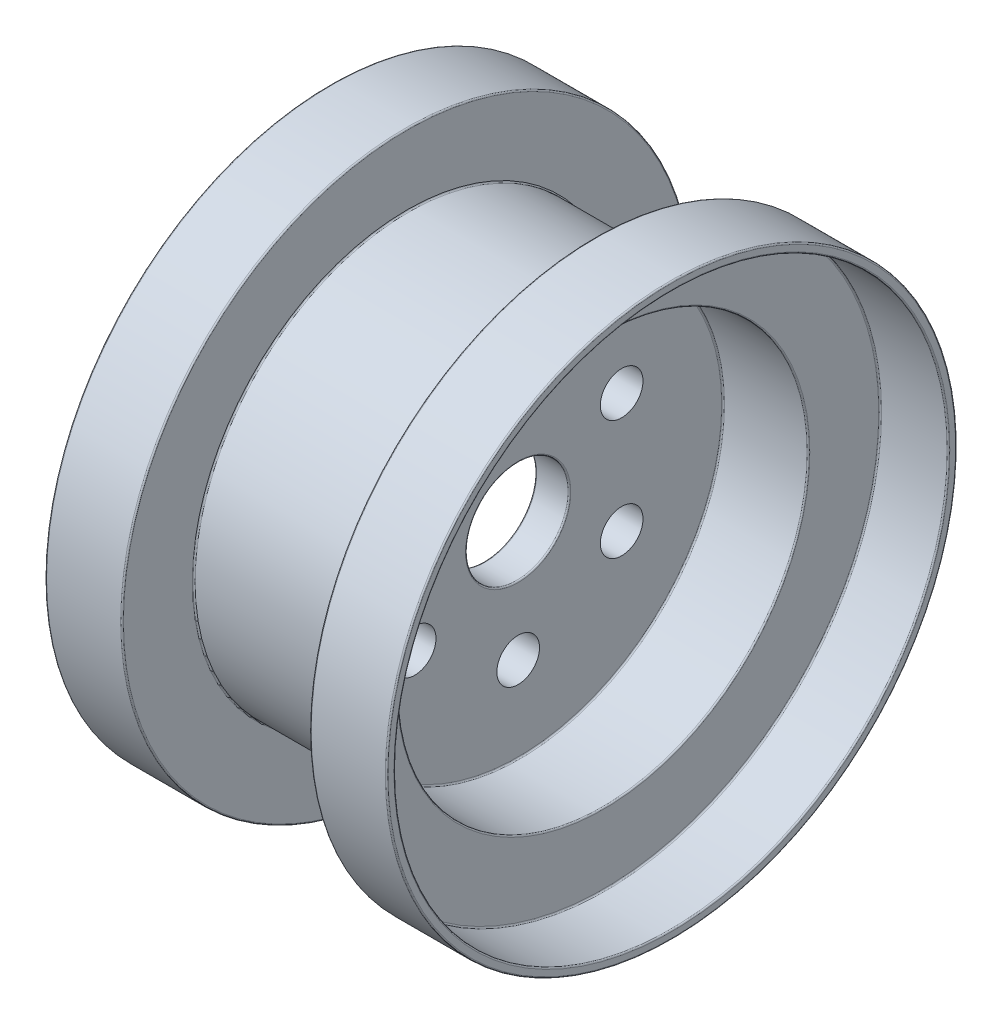
ISO-10303-21;
HEADER;
FILE_DESCRIPTION(('STEP AP214'),'2;1');
FILE_NAME('part.step','',(''),(''),'','','');
FILE_SCHEMA(('AUTOMOTIVE_DESIGN { 1 0 10303 214 1 1 1 1 }'));
ENDSEC;
DATA;
#1=APPLICATION_CONTEXT('core data for automotive mechanical design processes');
#2=APPLICATION_PROTOCOL_DEFINITION('international standard','automotive_design',2000,#1);
#3=PRODUCT_CONTEXT('',#1,'mechanical');
#4=PRODUCT('Part','Part','',(#3));
#5=PRODUCT_RELATED_PRODUCT_CATEGORY('part','',(#4));
#6=PRODUCT_DEFINITION_FORMATION('','',#4);
#7=PRODUCT_DEFINITION_CONTEXT('part definition',#1,'design');
#8=PRODUCT_DEFINITION('design','',#6,#7);
#9=PRODUCT_DEFINITION_SHAPE('','',#8);
#10=(LENGTH_UNIT() NAMED_UNIT(*) SI_UNIT(.MILLI.,.METRE.));
#11=(NAMED_UNIT(*) PLANE_ANGLE_UNIT() SI_UNIT($,.RADIAN.));
#12=(NAMED_UNIT(*) SI_UNIT($,.STERADIAN.) SOLID_ANGLE_UNIT());
#13=UNCERTAINTY_MEASURE_WITH_UNIT(LENGTH_MEASURE(1.E-05),#10,'distance_accuracy_value','');
#14=(GEOMETRIC_REPRESENTATION_CONTEXT(3) GLOBAL_UNCERTAINTY_ASSIGNED_CONTEXT((#13)) GLOBAL_UNIT_ASSIGNED_CONTEXT((#10,
#11,#12)) REPRESENTATION_CONTEXT('',''));
#15=CARTESIAN_POINT('',(0.,0.,0.));
#16=DIRECTION('',(0.,0.,1.));
#17=DIRECTION('',(1.,0.,0.));
#18=AXIS2_PLACEMENT_3D('',#15,#16,#17);
#19=CARTESIAN_POINT('',(9.19999999999993,0.,0.));
#20=DIRECTION('',(-1.,0.,0.));
#21=DIRECTION('',(0.,0.,1.));
#22=AXIS2_PLACEMENT_3D('',#19,#20,#21);
#23=TOROIDAL_SURFACE('',#22,30.8,0.8);
#24=CARTESIAN_POINT('',(9.99999999999993,0.,0.));
#25=DIRECTION('',(-1.,0.,0.));
#26=DIRECTION('',(0.,0.,1.));
#27=AXIS2_PLACEMENT_3D('',#24,#25,#26);
#28=CIRCLE('',#27,30.8);
#29=CARTESIAN_POINT('',(9.99999999999993,0.,30.8));
#30=VERTEX_POINT('',#29);
#31=EDGE_CURVE('E10',#30,#30,#28,.T.);
#32=ORIENTED_EDGE('',*,*,#31,.F.);
#33=EDGE_LOOP('',(#32));
#34=FACE_BOUND('',#33,.T.);
#35=CARTESIAN_POINT('',(9.19999999999993,0.,0.));
#36=DIRECTION('',(-1.,0.,0.));
#37=DIRECTION('',(0.,0.,1.));
#38=AXIS2_PLACEMENT_3D('',#35,#36,#37);
#39=CIRCLE('',#38,30.);
#40=CARTESIAN_POINT('',(9.19999999999993,0.,30.));
#41=VERTEX_POINT('',#40);
#42=EDGE_CURVE('E169',#41,#41,#39,.T.);
#43=ORIENTED_EDGE('',*,*,#42,.T.);
#44=EDGE_LOOP('',(#43));
#45=FACE_BOUND('',#44,.T.);
#46=ADVANCED_FACE('F36',(#34,#45),#23,.T.);
#47=CARTESIAN_POINT('',(9.99999999999997,30.8,0.));
#48=DIRECTION('',(-1.,0.,0.));
#49=DIRECTION('',(0.,0.,1.));
#50=AXIS2_PLACEMENT_3D('',#47,#48,#49);
#51=PLANE('',#50);
#52=CARTESIAN_POINT('',(9.99999999999997,70.,0.));
#53=DIRECTION('',(-1.,0.,0.));
#54=DIRECTION('',(0.,0.,1.));
#55=AXIS2_PLACEMENT_3D('',#52,#53,#54);
#56=CIRCLE('',#55,12.5);
#57=CARTESIAN_POINT('',(9.99999999999997,70.,12.5));
#58=VERTEX_POINT('',#57);
#59=EDGE_CURVE('E173',#58,#58,#56,.T.);
#60=ORIENTED_EDGE('',*,*,#59,.T.);
#61=EDGE_LOOP('',(#60));
#62=FACE_BOUND('',#61,.T.);
#63=CARTESIAN_POINT('',(9.99999999999997,35.0000000000007,-60.6217782649103));
#64=DIRECTION('',(-1.,0.,0.));
#65=DIRECTION('',(0.,0.,1.));
#66=AXIS2_PLACEMENT_3D('',#63,#64,#65);
#67=CIRCLE('',#66,12.5);
#68=CARTESIAN_POINT('',(9.99999999999997,35.0000000000007,-48.1217782649103));
#69=VERTEX_POINT('',#68);
#70=EDGE_CURVE('E177',#69,#69,#67,.T.);
#71=ORIENTED_EDGE('',*,*,#70,.T.);
#72=EDGE_LOOP('',(#71));
#73=FACE_BOUND('',#72,.T.);
#74=CARTESIAN_POINT('',(9.99999999999997,-35.0000000000017,-60.6217782649077));
#75=DIRECTION('',(-1.,0.,0.));
#76=DIRECTION('',(0.,0.,1.));
#77=AXIS2_PLACEMENT_3D('',#74,#75,#76);
#78=CIRCLE('',#77,12.500000000004);
#79=CARTESIAN_POINT('',(9.99999999999997,-35.0000000000017,-48.1217782649037));
#80=VERTEX_POINT('',#79);
#81=EDGE_CURVE('E181',#80,#80,#78,.T.);
#82=ORIENTED_EDGE('',*,*,#81,.T.);
#83=EDGE_LOOP('',(#82));
#84=FACE_BOUND('',#83,.T.);
#85=CARTESIAN_POINT('',(9.99999999999997,-70.,3.96366616547457E-12));
#86=DIRECTION('',(-1.,0.,0.));
#87=DIRECTION('',(0.,0.,1.));
#88=AXIS2_PLACEMENT_3D('',#85,#86,#87);
#89=CIRCLE('',#88,12.5000000000043);
#90=CARTESIAN_POINT('',(9.99999999999997,-70.,12.5000000000082));
#91=VERTEX_POINT('',#90);
#92=EDGE_CURVE('E185',#91,#91,#89,.T.);
#93=ORIENTED_EDGE('',*,*,#92,.T.);
#94=EDGE_LOOP('',(#93));
#95=FACE_BOUND('',#94,.T.);
#96=CARTESIAN_POINT('',(9.99999999999997,-35.0000000000003,60.6217782649105));
#97=DIRECTION('',(-1.,0.,0.));
#98=DIRECTION('',(0.,0.,1.));
#99=AXIS2_PLACEMENT_3D('',#96,#97,#98);
#100=CIRCLE('',#99,12.5);
#101=CARTESIAN_POINT('',(9.99999999999997,-35.0000000000003,73.1217782649105));
#102=VERTEX_POINT('',#101);
#103=EDGE_CURVE('E189',#102,#102,#100,.T.);
#104=ORIENTED_EDGE('',*,*,#103,.T.);
#105=EDGE_LOOP('',(#104));
#106=FACE_BOUND('',#105,.T.);
#107=CARTESIAN_POINT('',(9.99999999999997,34.9999999999998,60.6217782649108));
#108=DIRECTION('',(-1.,0.,0.));
#109=DIRECTION('',(0.,0.,1.));
#110=AXIS2_PLACEMENT_3D('',#107,#108,#109);
#111=CIRCLE('',#110,12.5);
#112=CARTESIAN_POINT('',(9.99999999999997,34.9999999999998,73.1217782649108));
#113=VERTEX_POINT('',#112);
#114=EDGE_CURVE('E193',#113,#113,#111,.T.);
#115=ORIENTED_EDGE('',*,*,#114,.T.);
#116=EDGE_LOOP('',(#115));
#117=FACE_BOUND('',#116,.T.);
#118=CARTESIAN_POINT('',(10.,0.,0.));
#119=DIRECTION('',(-1.,0.,0.));
#120=DIRECTION('',(0.,0.,1.));
#121=AXIS2_PLACEMENT_3D('',#118,#119,#120);
#122=CIRCLE('',#121,119.2);
#123=CARTESIAN_POINT('',(10.,0.,119.2));
#124=VERTEX_POINT('',#123);
#125=EDGE_CURVE('E43',#124,#124,#122,.T.);
#126=ORIENTED_EDGE('',*,*,#125,.F.);
#127=EDGE_LOOP('',(#126));
#128=FACE_BOUND('',#127,.T.);
#129=ORIENTED_EDGE('',*,*,#31,.T.);
#130=EDGE_LOOP('',(#129));
#131=FACE_BOUND('',#130,.T.);
#132=ADVANCED_FACE('F403',(#62,#73,#84,#95,#106,#117,#128,#131),#51,.F.);
#133=CARTESIAN_POINT('',(10.8,0.,0.));
#134=DIRECTION('',(-1.,0.,0.));
#135=DIRECTION('',(0.,0.,1.));
#136=AXIS2_PLACEMENT_3D('',#133,#134,#135);
#137=TOROIDAL_SURFACE('',#136,119.2,0.799999999999999);
#138=CARTESIAN_POINT('',(10.8,0.,0.));
#139=DIRECTION('',(-1.,0.,0.));
#140=DIRECTION('',(0.,0.,1.));
#141=AXIS2_PLACEMENT_3D('',#138,#139,#140);
#142=CIRCLE('',#141,120.);
#143=CARTESIAN_POINT('',(10.8,0.,120.));
#144=VERTEX_POINT('',#143);
#145=EDGE_CURVE('E49',#144,#144,#142,.T.);
#146=ORIENTED_EDGE('',*,*,#145,.F.);
#147=EDGE_LOOP('',(#146));
#148=FACE_BOUND('',#147,.T.);
#149=ORIENTED_EDGE('',*,*,#125,.T.);
#150=EDGE_LOOP('',(#149));
#151=FACE_BOUND('',#150,.T.);
#152=ADVANCED_FACE('F398',(#148,#151),#137,.F.);
#153=CARTESIAN_POINT('',(-81.9230769230769,0.,0.));
#154=DIRECTION('',(-1.,0.,0.));
#155=DIRECTION('',(0.,0.,1.));
#156=AXIS2_PLACEMENT_3D('',#153,#154,#155);
#157=CYLINDRICAL_SURFACE('',#156,120.);
#158=CARTESIAN_POINT('',(59.2,0.,0.));
#159=DIRECTION('',(-1.,0.,0.));
#160=DIRECTION('',(0.,0.,1.));
#161=AXIS2_PLACEMENT_3D('',#158,#159,#160);
#162=CIRCLE('',#161,120.);
#163=CARTESIAN_POINT('',(59.2,0.,120.));
#164=VERTEX_POINT('',#163);
#165=EDGE_CURVE('E55',#164,#164,#162,.T.);
#166=ORIENTED_EDGE('',*,*,#165,.F.);
#167=EDGE_LOOP('',(#166));
#168=FACE_BOUND('',#167,.T.);
#169=ORIENTED_EDGE('',*,*,#145,.T.);
#170=EDGE_LOOP('',(#169));
#171=FACE_BOUND('',#170,.T.);
#172=ADVANCED_FACE('F392',(#168,#171),#157,.F.);
#173=CARTESIAN_POINT('',(59.2,0.,0.));
#174=DIRECTION('',(-1.,0.,0.));
#175=DIRECTION('',(0.,0.,1.));
#176=AXIS2_PLACEMENT_3D('',#173,#174,#175);
#177=TOROIDAL_SURFACE('',#176,120.8,0.799999999999999);
#178=CARTESIAN_POINT('',(60.,0.,0.));
#179=DIRECTION('',(-1.,0.,0.));
#180=DIRECTION('',(0.,0.,1.));
#181=AXIS2_PLACEMENT_3D('',#178,#179,#180);
#182=CIRCLE('',#181,120.8);
#183=CARTESIAN_POINT('',(60.,0.,120.8));
#184=VERTEX_POINT('',#183);
#185=EDGE_CURVE('E61',#184,#184,#182,.T.);
#186=ORIENTED_EDGE('',*,*,#185,.F.);
#187=EDGE_LOOP('',(#186));
#188=FACE_BOUND('',#187,.T.);
#189=ORIENTED_EDGE('',*,*,#165,.T.);
#190=EDGE_LOOP('',(#189));
#191=FACE_BOUND('',#190,.T.);
#192=ADVANCED_FACE('F386',(#188,#191),#177,.T.);
#193=CARTESIAN_POINT('',(60.,120.8,0.));
#194=DIRECTION('',(-1.,0.,0.));
#195=DIRECTION('',(0.,0.,1.));
#196=AXIS2_PLACEMENT_3D('',#193,#194,#195);
#197=PLANE('',#196);
#198=CARTESIAN_POINT('',(60.,0.,0.));
#199=DIRECTION('',(-1.,0.,0.));
#200=DIRECTION('',(0.,0.,1.));
#201=AXIS2_PLACEMENT_3D('',#198,#199,#200);
#202=CIRCLE('',#201,161.2);
#203=CARTESIAN_POINT('',(60.,0.,161.2));
#204=VERTEX_POINT('',#203);
#205=EDGE_CURVE('E65',#204,#204,#202,.T.);
#206=ORIENTED_EDGE('',*,*,#205,.F.);
#207=EDGE_LOOP('',(#206));
#208=FACE_BOUND('',#207,.T.);
#209=ORIENTED_EDGE('',*,*,#185,.T.);
#210=EDGE_LOOP('',(#209));
#211=FACE_BOUND('',#210,.T.);
#212=ADVANCED_FACE('F380',(#208,#211),#197,.F.);
#213=CARTESIAN_POINT('',(60.8,0.,0.));
#214=DIRECTION('',(-1.,0.,0.));
#215=DIRECTION('',(0.,0.,1.));
#216=AXIS2_PLACEMENT_3D('',#213,#214,#215);
#217=TOROIDAL_SURFACE('',#216,161.2,0.799999999999999);
#218=CARTESIAN_POINT('',(60.8,0.,0.));
#219=DIRECTION('',(-1.,0.,0.));
#220=DIRECTION('',(0.,0.,1.));
#221=AXIS2_PLACEMENT_3D('',#218,#219,#220);
#222=CIRCLE('',#221,162.);
#223=CARTESIAN_POINT('',(60.8,0.,162.));
#224=VERTEX_POINT('',#223);
#225=EDGE_CURVE('E69',#224,#224,#222,.T.);
#226=ORIENTED_EDGE('',*,*,#225,.F.);
#227=EDGE_LOOP('',(#226));
#228=FACE_BOUND('',#227,.T.);
#229=ORIENTED_EDGE('',*,*,#205,.T.);
#230=EDGE_LOOP('',(#229));
#231=FACE_BOUND('',#230,.T.);
#232=ADVANCED_FACE('F374',(#228,#231),#217,.F.);
#233=CARTESIAN_POINT('',(-81.9230769230769,0.,0.));
#234=DIRECTION('',(-1.,0.,0.));
#235=DIRECTION('',(0.,0.,1.));
#236=AXIS2_PLACEMENT_3D('',#233,#234,#235);
#237=CYLINDRICAL_SURFACE('',#236,162.);
#238=CARTESIAN_POINT('',(99.2,0.,0.));
#239=DIRECTION('',(-1.,0.,0.));
#240=DIRECTION('',(0.,0.,1.));
#241=AXIS2_PLACEMENT_3D('',#238,#239,#240);
#242=CIRCLE('',#241,162.);
#243=CARTESIAN_POINT('',(99.2,0.,162.));
#244=VERTEX_POINT('',#243);
#245=EDGE_CURVE('E73',#244,#244,#242,.T.);
#246=ORIENTED_EDGE('',*,*,#245,.F.);
#247=EDGE_LOOP('',(#246));
#248=FACE_BOUND('',#247,.T.);
#249=ORIENTED_EDGE('',*,*,#225,.T.);
#250=EDGE_LOOP('',(#249));
#251=FACE_BOUND('',#250,.T.);
#252=ADVANCED_FACE('F368',(#248,#251),#237,.F.);
#253=CARTESIAN_POINT('',(99.2,0.,0.));
#254=DIRECTION('',(-1.,0.,0.));
#255=DIRECTION('',(0.,0.,1.));
#256=AXIS2_PLACEMENT_3D('',#253,#254,#255);
#257=TOROIDAL_SURFACE('',#256,162.8,0.799999999999995);
#258=CARTESIAN_POINT('',(100.,0.,0.));
#259=DIRECTION('',(-1.,0.,0.));
#260=DIRECTION('',(0.,0.,1.));
#261=AXIS2_PLACEMENT_3D('',#258,#259,#260);
#262=CIRCLE('',#261,162.8);
#263=CARTESIAN_POINT('',(100.,0.,162.8));
#264=VERTEX_POINT('',#263);
#265=EDGE_CURVE('E77',#264,#264,#262,.T.);
#266=ORIENTED_EDGE('',*,*,#265,.F.);
#267=EDGE_LOOP('',(#266));
#268=FACE_BOUND('',#267,.T.);
#269=ORIENTED_EDGE('',*,*,#245,.T.);
#270=EDGE_LOOP('',(#269));
#271=FACE_BOUND('',#270,.T.);
#272=ADVANCED_FACE('F362',(#268,#271),#257,.T.);
#273=CARTESIAN_POINT('',(100.,162.8,0.));
#274=DIRECTION('',(-1.,0.,0.));
#275=DIRECTION('',(0.,0.,1.));
#276=AXIS2_PLACEMENT_3D('',#273,#274,#275);
#277=PLANE('',#276);
#278=CARTESIAN_POINT('',(100.,0.,0.));
#279=DIRECTION('',(-1.,0.,0.));
#280=DIRECTION('',(0.,0.,1.));
#281=AXIS2_PLACEMENT_3D('',#278,#279,#280);
#282=CIRCLE('',#281,166.2);
#283=CARTESIAN_POINT('',(100.,0.,166.2));
#284=VERTEX_POINT('',#283);
#285=EDGE_CURVE('E81',#284,#284,#282,.T.);
#286=ORIENTED_EDGE('',*,*,#285,.F.);
#287=EDGE_LOOP('',(#286));
#288=FACE_BOUND('',#287,.T.);
#289=ORIENTED_EDGE('',*,*,#265,.T.);
#290=EDGE_LOOP('',(#289));
#291=FACE_BOUND('',#290,.T.);
#292=ADVANCED_FACE('F356',(#288,#291),#277,.F.);
#293=CARTESIAN_POINT('',(99.2,0.,0.));
#294=DIRECTION('',(-1.,0.,0.));
#295=DIRECTION('',(0.,0.,1.));
#296=AXIS2_PLACEMENT_3D('',#293,#294,#295);
#297=TOROIDAL_SURFACE('',#296,166.2,0.800000000000002);
#298=CARTESIAN_POINT('',(99.2,0.,0.));
#299=DIRECTION('',(-1.,0.,0.));
#300=DIRECTION('',(0.,0.,1.));
#301=AXIS2_PLACEMENT_3D('',#298,#299,#300);
#302=CIRCLE('',#301,167.);
#303=CARTESIAN_POINT('',(99.2,0.,167.));
#304=VERTEX_POINT('',#303);
#305=EDGE_CURVE('E85',#304,#304,#302,.T.);
#306=ORIENTED_EDGE('',*,*,#305,.F.);
#307=EDGE_LOOP('',(#306));
#308=FACE_BOUND('',#307,.T.);
#309=ORIENTED_EDGE('',*,*,#285,.T.);
#310=EDGE_LOOP('',(#309));
#311=FACE_BOUND('',#310,.T.);
#312=ADVANCED_FACE('F350',(#308,#311),#297,.T.);
#313=CARTESIAN_POINT('',(-81.9230769230769,0.,0.));
#314=DIRECTION('',(-1.,0.,0.));
#315=DIRECTION('',(0.,0.,1.));
#316=AXIS2_PLACEMENT_3D('',#313,#314,#315);
#317=CYLINDRICAL_SURFACE('',#316,167.);
#318=CARTESIAN_POINT('',(55.8,0.,0.));
#319=DIRECTION('',(-1.,0.,0.));
#320=DIRECTION('',(0.,0.,1.));
#321=AXIS2_PLACEMENT_3D('',#318,#319,#320);
#322=CIRCLE('',#321,167.);
#323=CARTESIAN_POINT('',(55.8,0.,167.));
#324=VERTEX_POINT('',#323);
#325=EDGE_CURVE('E89',#324,#324,#322,.T.);
#326=ORIENTED_EDGE('',*,*,#325,.F.);
#327=EDGE_LOOP('',(#326));
#328=FACE_BOUND('',#327,.T.);
#329=ORIENTED_EDGE('',*,*,#305,.T.);
#330=EDGE_LOOP('',(#329));
#331=FACE_BOUND('',#330,.T.);
#332=ADVANCED_FACE('F344',(#328,#331),#317,.T.);
#333=CARTESIAN_POINT('',(55.8,0.,0.));
#334=DIRECTION('',(-1.,0.,0.));
#335=DIRECTION('',(0.,0.,1.));
#336=AXIS2_PLACEMENT_3D('',#333,#334,#335);
#337=TOROIDAL_SURFACE('',#336,166.2,0.799999999999999);
#338=CARTESIAN_POINT('',(55.,0.,0.));
#339=DIRECTION('',(-1.,0.,0.));
#340=DIRECTION('',(0.,0.,1.));
#341=AXIS2_PLACEMENT_3D('',#338,#339,#340);
#342=CIRCLE('',#341,166.2);
#343=CARTESIAN_POINT('',(55.,0.,166.2));
#344=VERTEX_POINT('',#343);
#345=EDGE_CURVE('E93',#344,#344,#342,.T.);
#346=ORIENTED_EDGE('',*,*,#345,.F.);
#347=EDGE_LOOP('',(#346));
#348=FACE_BOUND('',#347,.T.);
#349=ORIENTED_EDGE('',*,*,#325,.T.);
#350=EDGE_LOOP('',(#349));
#351=FACE_BOUND('',#350,.T.);
#352=ADVANCED_FACE('F338',(#348,#351),#337,.T.);
#353=CARTESIAN_POINT('',(55.,166.2,0.));
#354=DIRECTION('',(1.,0.,0.));
#355=DIRECTION('',(0.,0.,-1.));
#356=AXIS2_PLACEMENT_3D('',#353,#354,#355);
#357=PLANE('',#356);
#358=CARTESIAN_POINT('',(55.,0.,0.));
#359=DIRECTION('',(-1.,0.,0.));
#360=DIRECTION('',(0.,0.,1.));
#361=AXIS2_PLACEMENT_3D('',#358,#359,#360);
#362=CIRCLE('',#361,125.8);
#363=CARTESIAN_POINT('',(55.,0.,125.8));
#364=VERTEX_POINT('',#363);
#365=EDGE_CURVE('E97',#364,#364,#362,.T.);
#366=ORIENTED_EDGE('',*,*,#365,.F.);
#367=EDGE_LOOP('',(#366));
#368=FACE_BOUND('',#367,.T.);
#369=ORIENTED_EDGE('',*,*,#345,.T.);
#370=EDGE_LOOP('',(#369));
#371=FACE_BOUND('',#370,.T.);
#372=ADVANCED_FACE('F332',(#368,#371),#357,.F.);
#373=CARTESIAN_POINT('',(54.2,0.,0.));
#374=DIRECTION('',(-1.,0.,0.));
#375=DIRECTION('',(0.,0.,1.));
#376=AXIS2_PLACEMENT_3D('',#373,#374,#375);
#377=TOROIDAL_SURFACE('',#376,125.8,0.799999999999999);
#378=CARTESIAN_POINT('',(54.2,0.,0.));
#379=DIRECTION('',(-1.,0.,0.));
#380=DIRECTION('',(0.,0.,1.));
#381=AXIS2_PLACEMENT_3D('',#378,#379,#380);
#382=CIRCLE('',#381,125.);
#383=CARTESIAN_POINT('',(54.2,0.,125.));
#384=VERTEX_POINT('',#383);
#385=EDGE_CURVE('E101',#384,#384,#382,.T.);
#386=ORIENTED_EDGE('',*,*,#385,.F.);
#387=EDGE_LOOP('',(#386));
#388=FACE_BOUND('',#387,.T.);
#389=ORIENTED_EDGE('',*,*,#365,.T.);
#390=EDGE_LOOP('',(#389));
#391=FACE_BOUND('',#390,.T.);
#392=ADVANCED_FACE('F326',(#388,#391),#377,.F.);
#393=CARTESIAN_POINT('',(-81.9230769230769,0.,0.));
#394=DIRECTION('',(-1.,0.,0.));
#395=DIRECTION('',(0.,0.,1.));
#396=AXIS2_PLACEMENT_3D('',#393,#394,#395);
#397=CYLINDRICAL_SURFACE('',#396,125.);
#398=CARTESIAN_POINT('',(-54.2,0.,0.));
#399=DIRECTION('',(-1.,0.,0.));
#400=DIRECTION('',(0.,0.,1.));
#401=AXIS2_PLACEMENT_3D('',#398,#399,#400);
#402=CIRCLE('',#401,125.);
#403=CARTESIAN_POINT('',(-54.2,0.,125.));
#404=VERTEX_POINT('',#403);
#405=EDGE_CURVE('E105',#404,#404,#402,.T.);
#406=ORIENTED_EDGE('',*,*,#405,.F.);
#407=EDGE_LOOP('',(#406));
#408=FACE_BOUND('',#407,.T.);
#409=ORIENTED_EDGE('',*,*,#385,.T.);
#410=EDGE_LOOP('',(#409));
#411=FACE_BOUND('',#410,.T.);
#412=ADVANCED_FACE('F320',(#408,#411),#397,.T.);
#413=CARTESIAN_POINT('',(-54.2,0.,0.));
#414=DIRECTION('',(-1.,0.,0.));
#415=DIRECTION('',(0.,0.,1.));
#416=AXIS2_PLACEMENT_3D('',#413,#414,#415);
#417=TOROIDAL_SURFACE('',#416,125.8,0.799999999999999);
#418=CARTESIAN_POINT('',(-55.,0.,0.));
#419=DIRECTION('',(-1.,0.,0.));
#420=DIRECTION('',(0.,0.,1.));
#421=AXIS2_PLACEMENT_3D('',#418,#419,#420);
#422=CIRCLE('',#421,125.8);
#423=CARTESIAN_POINT('',(-55.,0.,125.8));
#424=VERTEX_POINT('',#423);
#425=EDGE_CURVE('E109',#424,#424,#422,.T.);
#426=ORIENTED_EDGE('',*,*,#425,.F.);
#427=EDGE_LOOP('',(#426));
#428=FACE_BOUND('',#427,.T.);
#429=ORIENTED_EDGE('',*,*,#405,.T.);
#430=EDGE_LOOP('',(#429));
#431=FACE_BOUND('',#430,.T.);
#432=ADVANCED_FACE('F314',(#428,#431),#417,.F.);
#433=CARTESIAN_POINT('',(-55.,166.2,0.));
#434=DIRECTION('',(-1.,0.,0.));
#435=DIRECTION('',(0.,0.,1.));
#436=AXIS2_PLACEMENT_3D('',#433,#434,#435);
#437=PLANE('',#436);
#438=CARTESIAN_POINT('',(-55.,0.,0.));
#439=DIRECTION('',(-1.,0.,0.));
#440=DIRECTION('',(0.,0.,1.));
#441=AXIS2_PLACEMENT_3D('',#438,#439,#440);
#442=CIRCLE('',#441,166.2);
#443=CARTESIAN_POINT('',(-55.,0.,166.2));
#444=VERTEX_POINT('',#443);
#445=EDGE_CURVE('E113',#444,#444,#442,.T.);
#446=ORIENTED_EDGE('',*,*,#445,.F.);
#447=EDGE_LOOP('',(#446));
#448=FACE_BOUND('',#447,.T.);
#449=ORIENTED_EDGE('',*,*,#425,.T.);
#450=EDGE_LOOP('',(#449));
#451=FACE_BOUND('',#450,.T.);
#452=ADVANCED_FACE('F308',(#448,#451),#437,.F.);
#453=CARTESIAN_POINT('',(-55.8,0.,0.));
#454=DIRECTION('',(-1.,0.,0.));
#455=DIRECTION('',(0.,0.,1.));
#456=AXIS2_PLACEMENT_3D('',#453,#454,#455);
#457=TOROIDAL_SURFACE('',#456,166.2,0.799999999999999);
#458=CARTESIAN_POINT('',(-55.8,0.,0.));
#459=DIRECTION('',(-1.,0.,0.));
#460=DIRECTION('',(0.,0.,1.));
#461=AXIS2_PLACEMENT_3D('',#458,#459,#460);
#462=CIRCLE('',#461,167.);
#463=CARTESIAN_POINT('',(-55.8,0.,167.));
#464=VERTEX_POINT('',#463);
#465=EDGE_CURVE('E117',#464,#464,#462,.T.);
#466=ORIENTED_EDGE('',*,*,#465,.F.);
#467=EDGE_LOOP('',(#466));
#468=FACE_BOUND('',#467,.T.);
#469=ORIENTED_EDGE('',*,*,#445,.T.);
#470=EDGE_LOOP('',(#469));
#471=FACE_BOUND('',#470,.T.);
#472=ADVANCED_FACE('F302',(#468,#471),#457,.T.);
#473=CARTESIAN_POINT('',(-81.9230769230769,0.,0.));
#474=DIRECTION('',(-1.,0.,0.));
#475=DIRECTION('',(0.,0.,1.));
#476=AXIS2_PLACEMENT_3D('',#473,#474,#475);
#477=CYLINDRICAL_SURFACE('',#476,167.);
#478=CARTESIAN_POINT('',(-99.2,0.,0.));
#479=DIRECTION('',(-1.,0.,0.));
#480=DIRECTION('',(0.,0.,1.));
#481=AXIS2_PLACEMENT_3D('',#478,#479,#480);
#482=CIRCLE('',#481,167.);
#483=CARTESIAN_POINT('',(-99.2,0.,167.));
#484=VERTEX_POINT('',#483);
#485=EDGE_CURVE('E121',#484,#484,#482,.T.);
#486=ORIENTED_EDGE('',*,*,#485,.F.);
#487=EDGE_LOOP('',(#486));
#488=FACE_BOUND('',#487,.T.);
#489=ORIENTED_EDGE('',*,*,#465,.T.);
#490=EDGE_LOOP('',(#489));
#491=FACE_BOUND('',#490,.T.);
#492=ADVANCED_FACE('F296',(#488,#491),#477,.T.);
#493=CARTESIAN_POINT('',(-99.2,0.,0.));
#494=DIRECTION('',(-1.,0.,0.));
#495=DIRECTION('',(0.,0.,1.));
#496=AXIS2_PLACEMENT_3D('',#493,#494,#495);
#497=TOROIDAL_SURFACE('',#496,166.2,0.800000000000002);
#498=CARTESIAN_POINT('',(-100.,0.,0.));
#499=DIRECTION('',(-1.,0.,0.));
#500=DIRECTION('',(0.,0.,1.));
#501=AXIS2_PLACEMENT_3D('',#498,#499,#500);
#502=CIRCLE('',#501,166.2);
#503=CARTESIAN_POINT('',(-100.,0.,166.2));
#504=VERTEX_POINT('',#503);
#505=EDGE_CURVE('E125',#504,#504,#502,.T.);
#506=ORIENTED_EDGE('',*,*,#505,.F.);
#507=EDGE_LOOP('',(#506));
#508=FACE_BOUND('',#507,.T.);
#509=ORIENTED_EDGE('',*,*,#485,.T.);
#510=EDGE_LOOP('',(#509));
#511=FACE_BOUND('',#510,.T.);
#512=ADVANCED_FACE('F290',(#508,#511),#497,.T.);
#513=CARTESIAN_POINT('',(-100.,162.8,0.));
#514=DIRECTION('',(1.,0.,0.));
#515=DIRECTION('',(0.,0.,-1.));
#516=AXIS2_PLACEMENT_3D('',#513,#514,#515);
#517=PLANE('',#516);
#518=CARTESIAN_POINT('',(-100.,0.,0.));
#519=DIRECTION('',(-1.,0.,0.));
#520=DIRECTION('',(0.,0.,1.));
#521=AXIS2_PLACEMENT_3D('',#518,#519,#520);
#522=CIRCLE('',#521,162.8);
#523=CARTESIAN_POINT('',(-100.,0.,162.8));
#524=VERTEX_POINT('',#523);
#525=EDGE_CURVE('E129',#524,#524,#522,.T.);
#526=ORIENTED_EDGE('',*,*,#525,.F.);
#527=EDGE_LOOP('',(#526));
#528=FACE_BOUND('',#527,.T.);
#529=ORIENTED_EDGE('',*,*,#505,.T.);
#530=EDGE_LOOP('',(#529));
#531=FACE_BOUND('',#530,.T.);
#532=ADVANCED_FACE('F284',(#528,#531),#517,.F.);
#533=CARTESIAN_POINT('',(-99.2,0.,0.));
#534=DIRECTION('',(-1.,0.,0.));
#535=DIRECTION('',(0.,0.,1.));
#536=AXIS2_PLACEMENT_3D('',#533,#534,#535);
#537=TOROIDAL_SURFACE('',#536,162.8,0.799999999999995);
#538=CARTESIAN_POINT('',(-99.2,0.,0.));
#539=DIRECTION('',(-1.,0.,0.));
#540=DIRECTION('',(0.,0.,1.));
#541=AXIS2_PLACEMENT_3D('',#538,#539,#540);
#542=CIRCLE('',#541,162.);
#543=CARTESIAN_POINT('',(-99.2,0.,162.));
#544=VERTEX_POINT('',#543);
#545=EDGE_CURVE('E133',#544,#544,#542,.T.);
#546=ORIENTED_EDGE('',*,*,#545,.F.);
#547=EDGE_LOOP('',(#546));
#548=FACE_BOUND('',#547,.T.);
#549=ORIENTED_EDGE('',*,*,#525,.T.);
#550=EDGE_LOOP('',(#549));
#551=FACE_BOUND('',#550,.T.);
#552=ADVANCED_FACE('F278',(#548,#551),#537,.T.);
#553=CARTESIAN_POINT('',(-81.9230769230769,0.,0.));
#554=DIRECTION('',(-1.,0.,0.));
#555=DIRECTION('',(0.,0.,1.));
#556=AXIS2_PLACEMENT_3D('',#553,#554,#555);
#557=CYLINDRICAL_SURFACE('',#556,162.);
#558=CARTESIAN_POINT('',(-60.8,0.,0.));
#559=DIRECTION('',(-1.,0.,0.));
#560=DIRECTION('',(0.,0.,1.));
#561=AXIS2_PLACEMENT_3D('',#558,#559,#560);
#562=CIRCLE('',#561,162.);
#563=CARTESIAN_POINT('',(-60.8,0.,162.));
#564=VERTEX_POINT('',#563);
#565=EDGE_CURVE('E137',#564,#564,#562,.T.);
#566=ORIENTED_EDGE('',*,*,#565,.F.);
#567=EDGE_LOOP('',(#566));
#568=FACE_BOUND('',#567,.T.);
#569=ORIENTED_EDGE('',*,*,#545,.T.);
#570=EDGE_LOOP('',(#569));
#571=FACE_BOUND('',#570,.T.);
#572=ADVANCED_FACE('F272',(#568,#571),#557,.F.);
#573=CARTESIAN_POINT('',(-60.8,0.,0.));
#574=DIRECTION('',(-1.,0.,0.));
#575=DIRECTION('',(0.,0.,1.));
#576=AXIS2_PLACEMENT_3D('',#573,#574,#575);
#577=TOROIDAL_SURFACE('',#576,161.2,0.799999999999999);
#578=CARTESIAN_POINT('',(-60.,0.,0.));
#579=DIRECTION('',(-1.,0.,0.));
#580=DIRECTION('',(0.,0.,1.));
#581=AXIS2_PLACEMENT_3D('',#578,#579,#580);
#582=CIRCLE('',#581,161.2);
#583=CARTESIAN_POINT('',(-60.,0.,161.2));
#584=VERTEX_POINT('',#583);
#585=EDGE_CURVE('E141',#584,#584,#582,.T.);
#586=ORIENTED_EDGE('',*,*,#585,.F.);
#587=EDGE_LOOP('',(#586));
#588=FACE_BOUND('',#587,.T.);
#589=ORIENTED_EDGE('',*,*,#565,.T.);
#590=EDGE_LOOP('',(#589));
#591=FACE_BOUND('',#590,.T.);
#592=ADVANCED_FACE('F266',(#588,#591),#577,.F.);
#593=CARTESIAN_POINT('',(-60.,120.8,0.));
#594=DIRECTION('',(1.,0.,0.));
#595=DIRECTION('',(0.,0.,-1.));
#596=AXIS2_PLACEMENT_3D('',#593,#594,#595);
#597=PLANE('',#596);
#598=CARTESIAN_POINT('',(-60.,0.,0.));
#599=DIRECTION('',(-1.,0.,0.));
#600=DIRECTION('',(0.,0.,1.));
#601=AXIS2_PLACEMENT_3D('',#598,#599,#600);
#602=CIRCLE('',#601,120.8);
#603=CARTESIAN_POINT('',(-60.,0.,120.8));
#604=VERTEX_POINT('',#603);
#605=EDGE_CURVE('E145',#604,#604,#602,.T.);
#606=ORIENTED_EDGE('',*,*,#605,.F.);
#607=EDGE_LOOP('',(#606));
#608=FACE_BOUND('',#607,.T.);
#609=ORIENTED_EDGE('',*,*,#585,.T.);
#610=EDGE_LOOP('',(#609));
#611=FACE_BOUND('',#610,.T.);
#612=ADVANCED_FACE('F260',(#608,#611),#597,.F.);
#613=CARTESIAN_POINT('',(-59.2,0.,0.));
#614=DIRECTION('',(-1.,0.,0.));
#615=DIRECTION('',(0.,0.,1.));
#616=AXIS2_PLACEMENT_3D('',#613,#614,#615);
#617=TOROIDAL_SURFACE('',#616,120.8,0.799999999999999);
#618=CARTESIAN_POINT('',(-59.2,0.,0.));
#619=DIRECTION('',(-1.,0.,0.));
#620=DIRECTION('',(0.,0.,1.));
#621=AXIS2_PLACEMENT_3D('',#618,#619,#620);
#622=CIRCLE('',#621,120.);
#623=CARTESIAN_POINT('',(-59.2,0.,120.));
#624=VERTEX_POINT('',#623);
#625=EDGE_CURVE('E149',#624,#624,#622,.T.);
#626=ORIENTED_EDGE('',*,*,#625,.F.);
#627=EDGE_LOOP('',(#626));
#628=FACE_BOUND('',#627,.T.);
#629=ORIENTED_EDGE('',*,*,#605,.T.);
#630=EDGE_LOOP('',(#629));
#631=FACE_BOUND('',#630,.T.);
#632=ADVANCED_FACE('F254',(#628,#631),#617,.T.);
#633=CARTESIAN_POINT('',(-81.9230769230769,0.,0.));
#634=DIRECTION('',(-1.,0.,0.));
#635=DIRECTION('',(0.,0.,1.));
#636=AXIS2_PLACEMENT_3D('',#633,#634,#635);
#637=CYLINDRICAL_SURFACE('',#636,120.);
#638=CARTESIAN_POINT('',(-10.8,0.,0.));
#639=DIRECTION('',(-1.,0.,0.));
#640=DIRECTION('',(0.,0.,1.));
#641=AXIS2_PLACEMENT_3D('',#638,#639,#640);
#642=CIRCLE('',#641,120.);
#643=CARTESIAN_POINT('',(-10.8,0.,120.));
#644=VERTEX_POINT('',#643);
#645=EDGE_CURVE('E153',#644,#644,#642,.T.);
#646=ORIENTED_EDGE('',*,*,#645,.F.);
#647=EDGE_LOOP('',(#646));
#648=FACE_BOUND('',#647,.T.);
#649=ORIENTED_EDGE('',*,*,#625,.T.);
#650=EDGE_LOOP('',(#649));
#651=FACE_BOUND('',#650,.T.);
#652=ADVANCED_FACE('F248',(#648,#651),#637,.F.);
#653=CARTESIAN_POINT('',(-10.8,0.,0.));
#654=DIRECTION('',(-1.,0.,0.));
#655=DIRECTION('',(0.,0.,1.));
#656=AXIS2_PLACEMENT_3D('',#653,#654,#655);
#657=TOROIDAL_SURFACE('',#656,119.2,0.799999999999999);
#658=CARTESIAN_POINT('',(-10.,0.,0.));
#659=DIRECTION('',(-1.,0.,0.));
#660=DIRECTION('',(0.,0.,1.));
#661=AXIS2_PLACEMENT_3D('',#658,#659,#660);
#662=CIRCLE('',#661,119.2);
#663=CARTESIAN_POINT('',(-10.,0.,119.2));
#664=VERTEX_POINT('',#663);
#665=EDGE_CURVE('E157',#664,#664,#662,.T.);
#666=ORIENTED_EDGE('',*,*,#665,.F.);
#667=EDGE_LOOP('',(#666));
#668=FACE_BOUND('',#667,.T.);
#669=ORIENTED_EDGE('',*,*,#645,.T.);
#670=EDGE_LOOP('',(#669));
#671=FACE_BOUND('',#670,.T.);
#672=ADVANCED_FACE('F230',(#668,#671),#657,.F.);
#673=CARTESIAN_POINT('',(-9.99999999999995,30.8,0.));
#674=DIRECTION('',(1.,0.,0.));
#675=DIRECTION('',(0.,0.,-1.));
#676=AXIS2_PLACEMENT_3D('',#673,#674,#675);
#677=PLANE('',#676);
#678=CARTESIAN_POINT('',(-9.99999999999995,70.,0.));
#679=DIRECTION('',(-1.,0.,0.));
#680=DIRECTION('',(0.,0.,1.));
#681=AXIS2_PLACEMENT_3D('',#678,#679,#680);
#682=CIRCLE('',#681,12.5);
#683=CARTESIAN_POINT('',(-9.99999999999995,70.,12.5));
#684=VERTEX_POINT('',#683);
#685=EDGE_CURVE('E197',#684,#684,#682,.T.);
#686=ORIENTED_EDGE('',*,*,#685,.F.);
#687=EDGE_LOOP('',(#686));
#688=FACE_BOUND('',#687,.T.);
#689=CARTESIAN_POINT('',(-9.99999999999995,35.0000000000007,-60.6217782649103));
#690=DIRECTION('',(-1.,0.,0.));
#691=DIRECTION('',(0.,0.,1.));
#692=AXIS2_PLACEMENT_3D('',#689,#690,#691);
#693=CIRCLE('',#692,12.5);
#694=CARTESIAN_POINT('',(-9.99999999999995,35.0000000000007,-48.1217782649103));
#695=VERTEX_POINT('',#694);
#696=EDGE_CURVE('E203',#695,#695,#693,.T.);
#697=ORIENTED_EDGE('',*,*,#696,.F.);
#698=EDGE_LOOP('',(#697));
#699=FACE_BOUND('',#698,.T.);
#700=CARTESIAN_POINT('',(-9.99999999999995,-35.0000000000017,-60.6217782649077));
#701=DIRECTION('',(-1.,0.,0.));
#702=DIRECTION('',(0.,0.,1.));
#703=AXIS2_PLACEMENT_3D('',#700,#701,#702);
#704=CIRCLE('',#703,12.500000000004);
#705=CARTESIAN_POINT('',(-9.99999999999995,-35.0000000000017,-48.1217782649037));
#706=VERTEX_POINT('',#705);
#707=EDGE_CURVE('E198',#706,#706,#704,.T.);
#708=ORIENTED_EDGE('',*,*,#707,.F.);
#709=EDGE_LOOP('',(#708));
#710=FACE_BOUND('',#709,.T.);
#711=CARTESIAN_POINT('',(-9.99999999999995,-70.,3.96366616547457E-12));
#712=DIRECTION('',(-1.,0.,0.));
#713=DIRECTION('',(0.,0.,1.));
#714=AXIS2_PLACEMENT_3D('',#711,#712,#713);
#715=CIRCLE('',#714,12.5000000000043);
#716=CARTESIAN_POINT('',(-9.99999999999995,-70.,12.5000000000082));
#717=VERTEX_POINT('',#716);
#718=EDGE_CURVE('E202',#717,#717,#715,.T.);
#719=ORIENTED_EDGE('',*,*,#718,.F.);
#720=EDGE_LOOP('',(#719));
#721=FACE_BOUND('',#720,.T.);
#722=CARTESIAN_POINT('',(-9.99999999999995,-35.0000000000003,60.6217782649105));
#723=DIRECTION('',(-1.,0.,0.));
#724=DIRECTION('',(0.,0.,1.));
#725=AXIS2_PLACEMENT_3D('',#722,#723,#724);
#726=CIRCLE('',#725,12.5);
#727=CARTESIAN_POINT('',(-9.99999999999995,-35.0000000000003,73.1217782649105));
#728=VERTEX_POINT('',#727);
#729=EDGE_CURVE('E207',#728,#728,#726,.T.);
#730=ORIENTED_EDGE('',*,*,#729,.F.);
#731=EDGE_LOOP('',(#730));
#732=FACE_BOUND('',#731,.T.);
#733=CARTESIAN_POINT('',(-9.99999999999995,34.9999999999998,60.6217782649108));
#734=DIRECTION('',(-1.,0.,0.));
#735=DIRECTION('',(0.,0.,1.));
#736=AXIS2_PLACEMENT_3D('',#733,#734,#735);
#737=CIRCLE('',#736,12.5);
#738=CARTESIAN_POINT('',(-9.99999999999995,34.9999999999998,73.1217782649108));
#739=VERTEX_POINT('',#738);
#740=EDGE_CURVE('E211',#739,#739,#737,.T.);
#741=ORIENTED_EDGE('',*,*,#740,.F.);
#742=EDGE_LOOP('',(#741));
#743=FACE_BOUND('',#742,.T.);
#744=CARTESIAN_POINT('',(-9.99999999999988,0.,0.));
#745=DIRECTION('',(-1.,0.,0.));
#746=DIRECTION('',(0.,0.,1.));
#747=AXIS2_PLACEMENT_3D('',#744,#745,#746);
#748=CIRCLE('',#747,30.8);
#749=CARTESIAN_POINT('',(-9.99999999999988,0.,30.8));
#750=VERTEX_POINT('',#749);
#751=EDGE_CURVE('E161',#750,#750,#748,.T.);
#752=ORIENTED_EDGE('',*,*,#751,.F.);
#753=EDGE_LOOP('',(#752));
#754=FACE_BOUND('',#753,.T.);
#755=ORIENTED_EDGE('',*,*,#665,.T.);
#756=EDGE_LOOP('',(#755));
#757=FACE_BOUND('',#756,.T.);
#758=ADVANCED_FACE('F226',(#688,#699,#710,#721,#732,#743,#754,#757),#677,.F.);
#759=CARTESIAN_POINT('',(-9.19999999999989,0.,0.));
#760=DIRECTION('',(-1.,0.,0.));
#761=DIRECTION('',(0.,0.,1.));
#762=AXIS2_PLACEMENT_3D('',#759,#760,#761);
#763=TOROIDAL_SURFACE('',#762,30.8,0.8);
#764=CARTESIAN_POINT('',(-9.19999999999989,0.,0.));
#765=DIRECTION('',(-1.,0.,0.));
#766=DIRECTION('',(0.,0.,1.));
#767=AXIS2_PLACEMENT_3D('',#764,#765,#766);
#768=CIRCLE('',#767,30.);
#769=CARTESIAN_POINT('',(-9.19999999999989,0.,30.));
#770=VERTEX_POINT('',#769);
#771=EDGE_CURVE('E165',#770,#770,#768,.T.);
#772=ORIENTED_EDGE('',*,*,#771,.F.);
#773=EDGE_LOOP('',(#772));
#774=FACE_BOUND('',#773,.T.);
#775=ORIENTED_EDGE('',*,*,#751,.T.);
#776=EDGE_LOOP('',(#775));
#777=FACE_BOUND('',#776,.T.);
#778=ADVANCED_FACE('F229',(#774,#777),#763,.T.);
#779=CARTESIAN_POINT('',(-81.9230769230769,0.,0.));
#780=DIRECTION('',(-1.,0.,0.));
#781=DIRECTION('',(0.,0.,1.));
#782=AXIS2_PLACEMENT_3D('',#779,#780,#781);
#783=CYLINDRICAL_SURFACE('',#782,30.);
#784=ORIENTED_EDGE('',*,*,#42,.F.);
#785=EDGE_LOOP('',(#784));
#786=FACE_BOUND('',#785,.T.);
#787=ORIENTED_EDGE('',*,*,#771,.T.);
#788=EDGE_LOOP('',(#787));
#789=FACE_BOUND('',#788,.T.);
#790=ADVANCED_FACE('F416',(#786,#789),#783,.F.);
#791=CARTESIAN_POINT('',(100.,34.9999999999998,60.6217782649108));
#792=DIRECTION('',(-1.,0.,0.));
#793=DIRECTION('',(0.,0.,1.));
#794=AXIS2_PLACEMENT_3D('',#791,#792,#793);
#795=CYLINDRICAL_SURFACE('',#794,12.5);
#796=ORIENTED_EDGE('',*,*,#740,.T.);
#797=EDGE_LOOP('',(#796));
#798=FACE_BOUND('',#797,.T.);
#799=ORIENTED_EDGE('',*,*,#114,.F.);
#800=EDGE_LOOP('',(#799));
#801=FACE_BOUND('',#800,.T.);
#802=ADVANCED_FACE('F419',(#798,#801),#795,.F.);
#803=CARTESIAN_POINT('',(100.,-35.0000000000003,60.6217782649105));
#804=DIRECTION('',(-1.,0.,0.));
#805=DIRECTION('',(0.,0.,1.));
#806=AXIS2_PLACEMENT_3D('',#803,#804,#805);
#807=CYLINDRICAL_SURFACE('',#806,12.5);
#808=ORIENTED_EDGE('',*,*,#729,.T.);
#809=EDGE_LOOP('',(#808));
#810=FACE_BOUND('',#809,.T.);
#811=ORIENTED_EDGE('',*,*,#103,.F.);
#812=EDGE_LOOP('',(#811));
#813=FACE_BOUND('',#812,.T.);
#814=ADVANCED_FACE('F437',(#810,#813),#807,.F.);
#815=CARTESIAN_POINT('',(100.,-70.,3.96366616547457E-12));
#816=DIRECTION('',(-1.,0.,0.));
#817=DIRECTION('',(0.,0.,1.));
#818=AXIS2_PLACEMENT_3D('',#815,#816,#817);
#819=CYLINDRICAL_SURFACE('',#818,12.5000000000043);
#820=ORIENTED_EDGE('',*,*,#718,.T.);
#821=EDGE_LOOP('',(#820));
#822=FACE_BOUND('',#821,.T.);
#823=ORIENTED_EDGE('',*,*,#92,.F.);
#824=EDGE_LOOP('',(#823));
#825=FACE_BOUND('',#824,.T.);
#826=ADVANCED_FACE('F433',(#822,#825),#819,.F.);
#827=CARTESIAN_POINT('',(100.,-35.0000000000017,-60.6217782649077));
#828=DIRECTION('',(-1.,0.,0.));
#829=DIRECTION('',(0.,0.,1.));
#830=AXIS2_PLACEMENT_3D('',#827,#828,#829);
#831=CYLINDRICAL_SURFACE('',#830,12.500000000004);
#832=ORIENTED_EDGE('',*,*,#707,.T.);
#833=EDGE_LOOP('',(#832));
#834=FACE_BOUND('',#833,.T.);
#835=ORIENTED_EDGE('',*,*,#81,.F.);
#836=EDGE_LOOP('',(#835));
#837=FACE_BOUND('',#836,.T.);
#838=ADVANCED_FACE('F429',(#834,#837),#831,.F.);
#839=CARTESIAN_POINT('',(100.,35.0000000000007,-60.6217782649103));
#840=DIRECTION('',(-1.,0.,0.));
#841=DIRECTION('',(0.,0.,1.));
#842=AXIS2_PLACEMENT_3D('',#839,#840,#841);
#843=CYLINDRICAL_SURFACE('',#842,12.5);
#844=ORIENTED_EDGE('',*,*,#696,.T.);
#845=EDGE_LOOP('',(#844));
#846=FACE_BOUND('',#845,.T.);
#847=ORIENTED_EDGE('',*,*,#70,.F.);
#848=EDGE_LOOP('',(#847));
#849=FACE_BOUND('',#848,.T.);
#850=ADVANCED_FACE('F432',(#846,#849),#843,.F.);
#851=CARTESIAN_POINT('',(100.,70.,0.));
#852=DIRECTION('',(-1.,0.,0.));
#853=DIRECTION('',(0.,0.,1.));
#854=AXIS2_PLACEMENT_3D('',#851,#852,#853);
#855=CYLINDRICAL_SURFACE('',#854,12.5);
#856=ORIENTED_EDGE('',*,*,#685,.T.);
#857=EDGE_LOOP('',(#856));
#858=FACE_BOUND('',#857,.T.);
#859=ORIENTED_EDGE('',*,*,#59,.F.);
#860=EDGE_LOOP('',(#859));
#861=FACE_BOUND('',#860,.T.);
#862=ADVANCED_FACE('F223',(#858,#861),#855,.F.);
#863=CLOSED_SHELL('',(#46,#132,#152,#172,#192,#212,#232,#252,#272,#292,#312,#332,#352,#372,#392,
#412,#432,#452,#472,#492,#512,#532,#552,#572,#592,#612,#632,#652,#672,#758,#778,#790,#802,#814,
#826,#838,#850,#862));
#864=MANIFOLD_SOLID_BREP('B2',#863);
#865=ADVANCED_BREP_SHAPE_REPRESENTATION('',(#18,#864),#14);
#866=SHAPE_DEFINITION_REPRESENTATION(#9,#865);
ENDSEC;
END-ISO-10303-21;
